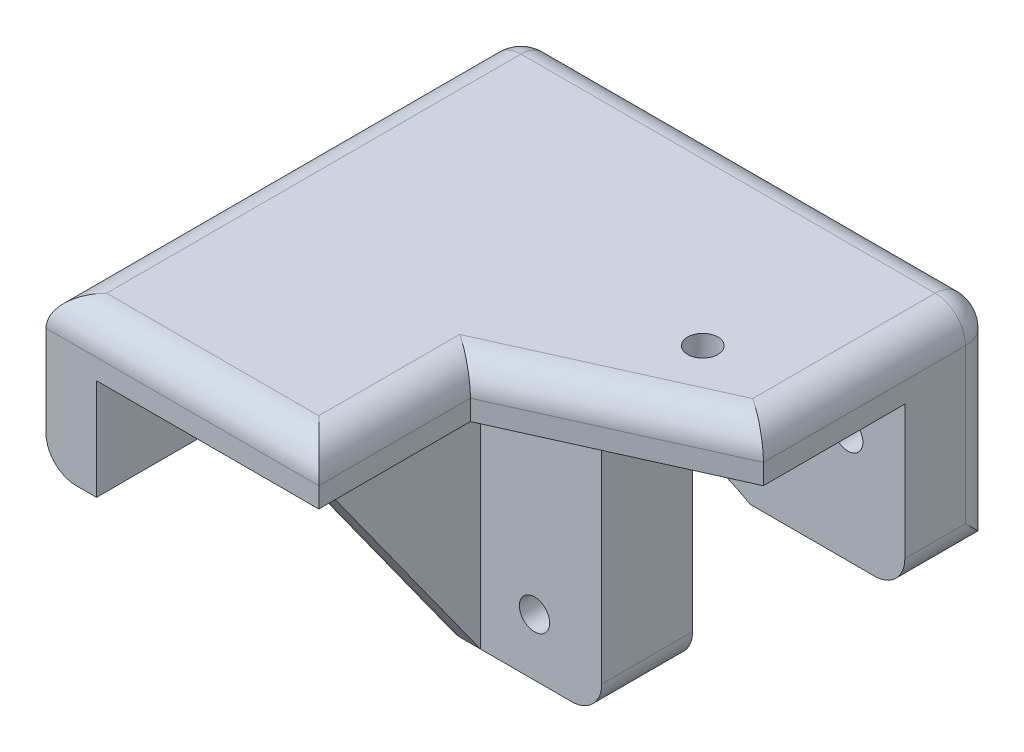
ISO-10303-21;
HEADER;
FILE_DESCRIPTION(('STEP AP214'),'2;1');
FILE_NAME('part.step','',(''),(''),'','','');
FILE_SCHEMA(('AUTOMOTIVE_DESIGN { 1 0 10303 214 1 1 1 1 }'));
ENDSEC;
DATA;
#1=APPLICATION_CONTEXT('core data for automotive mechanical design processes');
#2=APPLICATION_PROTOCOL_DEFINITION('international standard','automotive_design',2000,#1);
#3=PRODUCT_CONTEXT('',#1,'mechanical');
#4=PRODUCT('Part','Part','',(#3));
#5=PRODUCT_RELATED_PRODUCT_CATEGORY('part','',(#4));
#6=PRODUCT_DEFINITION_FORMATION('','',#4);
#7=PRODUCT_DEFINITION_CONTEXT('part definition',#1,'design');
#8=PRODUCT_DEFINITION('design','',#6,#7);
#9=PRODUCT_DEFINITION_SHAPE('','',#8);
#10=(LENGTH_UNIT() NAMED_UNIT(*) SI_UNIT(.MILLI.,.METRE.));
#11=(NAMED_UNIT(*) PLANE_ANGLE_UNIT() SI_UNIT($,.RADIAN.));
#12=(NAMED_UNIT(*) SI_UNIT($,.STERADIAN.) SOLID_ANGLE_UNIT());
#13=UNCERTAINTY_MEASURE_WITH_UNIT(LENGTH_MEASURE(1.E-05),#10,'distance_accuracy_value','');
#14=(GEOMETRIC_REPRESENTATION_CONTEXT(3) GLOBAL_UNCERTAINTY_ASSIGNED_CONTEXT((#13)) GLOBAL_UNIT_ASSIGNED_CONTEXT((#10,
#11,#12)) REPRESENTATION_CONTEXT('',''));
#15=CARTESIAN_POINT('',(0.,0.,0.));
#16=DIRECTION('',(0.,0.,1.));
#17=DIRECTION('',(1.,0.,0.));
#18=AXIS2_PLACEMENT_3D('',#15,#16,#17);
#19=CARTESIAN_POINT('',(37.,52.,19.));
#20=DIRECTION('',(0.,-1.,0.));
#21=DIRECTION('',(0.,0.,-1.));
#22=AXIS2_PLACEMENT_3D('',#19,#20,#21);
#23=CYLINDRICAL_SURFACE('',#22,1.5);
#24=CARTESIAN_POINT('',(37.,47.,19.));
#25=DIRECTION('',(0.,-1.,0.));
#26=DIRECTION('',(0.,0.,-1.));
#27=AXIS2_PLACEMENT_3D('',#24,#25,#26);
#28=CIRCLE('',#27,1.5);
#29=CARTESIAN_POINT('',(37.,47.,17.5));
#30=VERTEX_POINT('',#29);
#31=EDGE_CURVE('E327',#30,#30,#28,.T.);
#32=ORIENTED_EDGE('',*,*,#31,.F.);
#33=EDGE_LOOP('',(#32));
#34=FACE_BOUND('',#33,.T.);
#35=CARTESIAN_POINT('',(37.,44.,19.));
#36=DIRECTION('',(0.,-1.,0.));
#37=DIRECTION('',(0.,0.,-1.));
#38=AXIS2_PLACEMENT_3D('',#35,#36,#37);
#39=CIRCLE('',#38,1.5);
#40=CARTESIAN_POINT('',(37.,44.,17.5));
#41=VERTEX_POINT('',#40);
#42=EDGE_CURVE('E37',#41,#41,#39,.F.);
#43=ORIENTED_EDGE('',*,*,#42,.F.);
#44=EDGE_LOOP('',(#43));
#45=FACE_BOUND('',#44,.T.);
#46=ADVANCED_FACE('F33',(#34,#45),#23,.F.);
#47=CARTESIAN_POINT('',(47.,47.,9.));
#48=DIRECTION('',(-1.,0.,0.));
#49=DIRECTION('',(0.,-1.,0.));
#50=AXIS2_PLACEMENT_3D('',#47,#48,#49);
#51=PLANE('',#50);
#52=DIRECTION('',(0.,1.,0.));
#53=VECTOR('',#52,1.);
#54=CARTESIAN_POINT('',(47.,47.,3.));
#55=LINE('',#54,#53);
#56=CARTESIAN_POINT('',(47.,28.75,3.));
#57=VERTEX_POINT('',#56);
#58=CARTESIAN_POINT('',(47.,44.,3.));
#59=VERTEX_POINT('',#58);
#60=EDGE_CURVE('E295',#57,#59,#55,.T.);
#61=ORIENTED_EDGE('',*,*,#60,.T.);
#62=DIRECTION('',(0.,0.,-1.));
#63=VECTOR('',#62,1.);
#64=CARTESIAN_POINT('',(47.,44.,9.));
#65=LINE('',#64,#63);
#66=CARTESIAN_POINT('',(47.,44.,23.));
#67=VERTEX_POINT('',#66);
#68=EDGE_CURVE('E196',#59,#67,#65,.F.);
#69=ORIENTED_EDGE('',*,*,#68,.T.);
#70=DIRECTION('',(0.,-1.,0.));
#71=VECTOR('',#70,1.);
#72=CARTESIAN_POINT('',(47.,52.,23.));
#73=LINE('',#72,#71);
#74=CARTESIAN_POINT('',(47.,42.,23.));
#75=VERTEX_POINT('',#74);
#76=EDGE_CURVE('E188',#67,#75,#73,.T.);
#77=ORIENTED_EDGE('',*,*,#76,.T.);
#78=DIRECTION('',(0.,0.,-1.));
#79=VECTOR('',#78,1.);
#80=CARTESIAN_POINT('',(47.,42.,47.));
#81=LINE('',#80,#79);
#82=CARTESIAN_POINT('',(47.,42.,9.));
#83=VERTEX_POINT('',#82);
#84=EDGE_CURVE('E193',#75,#83,#81,.T.);
#85=ORIENTED_EDGE('',*,*,#84,.T.);
#86=DIRECTION('',(0.,1.,0.));
#87=VECTOR('',#86,1.);
#88=CARTESIAN_POINT('',(47.,47.,9.));
#89=LINE('',#88,#87);
#90=CARTESIAN_POINT('',(47.,28.75,9.));
#91=VERTEX_POINT('',#90);
#92=EDGE_CURVE('E502',#91,#83,#89,.T.);
#93=ORIENTED_EDGE('',*,*,#92,.F.);
#94=DIRECTION('',(0.,0.,-1.));
#95=VECTOR('',#94,1.);
#96=CARTESIAN_POINT('',(47.,28.75,9.));
#97=LINE('',#96,#95);
#98=EDGE_CURVE('E293',#91,#57,#97,.T.);
#99=ORIENTED_EDGE('',*,*,#98,.T.);
#100=EDGE_LOOP('',(#61,#69,#77,#85,#93,#99));
#101=FACE_BOUND('',#100,.T.);
#102=ADVANCED_FACE('F190',(#101),#51,.F.);
#103=CARTESIAN_POINT('',(0.,47.,9.));
#104=DIRECTION('',(0.,-1.,0.));
#105=DIRECTION('',(0.,0.,-1.));
#106=AXIS2_PLACEMENT_3D('',#103,#104,#105);
#107=PLANE('',#106);
#108=ORIENTED_EDGE('',*,*,#31,.T.);
#109=EDGE_LOOP('',(#108));
#110=FACE_BOUND('',#109,.T.);
#111=DIRECTION('',(0.,0.,-1.));
#112=VECTOR('',#111,1.);
#113=CARTESIAN_POINT('',(3.,47.,9.));
#114=LINE('',#113,#112);
#115=CARTESIAN_POINT('',(3.,47.,3.));
#116=VERTEX_POINT('',#115);
#117=CARTESIAN_POINT('',(3.,47.,44.));
#118=VERTEX_POINT('',#117);
#119=EDGE_CURVE('E270',#116,#118,#114,.F.);
#120=ORIENTED_EDGE('',*,*,#119,.T.);
#121=DIRECTION('',(-1.,0.,0.));
#122=VECTOR('',#121,1.);
#123=CARTESIAN_POINT('',(0.,47.,44.));
#124=LINE('',#123,#122);
#125=CARTESIAN_POINT('',(24.,47.,44.));
#126=VERTEX_POINT('',#125);
#127=EDGE_CURVE('E272',#118,#126,#124,.F.);
#128=ORIENTED_EDGE('',*,*,#127,.T.);
#129=DIRECTION('',(0.,0.,1.));
#130=VECTOR('',#129,1.);
#131=CARTESIAN_POINT('',(24.,47.,32.));
#132=LINE('',#131,#130);
#133=CARTESIAN_POINT('',(24.,47.,30.0602431700808));
#134=VERTEX_POINT('',#133);
#135=EDGE_CURVE('E262',#126,#134,#132,.F.);
#136=ORIENTED_EDGE('',*,*,#135,.T.);
#137=DIRECTION('',(-0.911921505175106,0.,0.410364677328798));
#138=VECTOR('',#137,1.);
#139=CARTESIAN_POINT('',(45.7689059680136,47.,20.2642354844747));
#140=LINE('',#139,#138);
#141=CARTESIAN_POINT('',(44.,47.,21.0602431700808));
#142=VERTEX_POINT('',#141);
#143=EDGE_CURVE('E264',#134,#142,#140,.F.);
#144=ORIENTED_EDGE('',*,*,#143,.T.);
#145=DIRECTION('',(0.,0.,-1.));
#146=VECTOR('',#145,1.);
#147=CARTESIAN_POINT('',(44.,47.,9.));
#148=LINE('',#147,#146);
#149=CARTESIAN_POINT('',(44.,47.,3.));
#150=VERTEX_POINT('',#149);
#151=EDGE_CURVE('E266',#142,#150,#148,.T.);
#152=ORIENTED_EDGE('',*,*,#151,.T.);
#153=DIRECTION('',(-1.,0.,0.));
#154=VECTOR('',#153,1.);
#155=CARTESIAN_POINT('',(0.,47.,3.));
#156=LINE('',#155,#154);
#157=EDGE_CURVE('E268',#150,#116,#156,.T.);
#158=ORIENTED_EDGE('',*,*,#157,.T.);
#159=EDGE_LOOP('',(#120,#128,#136,#144,#152,#158));
#160=FACE_BOUND('',#159,.T.);
#161=ADVANCED_FACE('F558',(#110,#160),#107,.F.);
#162=CARTESIAN_POINT('',(0.,0.,47.));
#163=DIRECTION('',(0.,0.,-1.));
#164=DIRECTION('',(-1.,0.,0.));
#165=AXIS2_PLACEMENT_3D('',#162,#163,#164);
#166=PLANE('',#165);
#167=DIRECTION('',(0.,-1.,0.));
#168=VECTOR('',#167,1.);
#169=CARTESIAN_POINT('',(27.,52.,47.));
#170=LINE('',#169,#168);
#171=CARTESIAN_POINT('',(27.,44.,47.));
#172=VERTEX_POINT('',#171);
#173=CARTESIAN_POINT('',(27.,42.,47.));
#174=VERTEX_POINT('',#173);
#175=EDGE_CURVE('E199',#172,#174,#170,.T.);
#176=ORIENTED_EDGE('',*,*,#175,.F.);
#177=DIRECTION('',(-1.,0.,0.));
#178=VECTOR('',#177,1.);
#179=CARTESIAN_POINT('',(0.,44.,47.));
#180=LINE('',#179,#178);
#181=CARTESIAN_POINT('',(0.,44.,47.));
#182=VERTEX_POINT('',#181);
#183=EDGE_CURVE('E259',#172,#182,#180,.T.);
#184=ORIENTED_EDGE('',*,*,#183,.T.);
#185=DIRECTION('',(0.,-1.,0.));
#186=VECTOR('',#185,1.);
#187=CARTESIAN_POINT('',(0.,0.,47.));
#188=LINE('',#187,#186);
#189=CARTESIAN_POINT('',(0.,35.,47.));
#190=VERTEX_POINT('',#189);
#191=EDGE_CURVE('E231',#182,#190,#188,.T.);
#192=ORIENTED_EDGE('',*,*,#191,.T.);
#193=CARTESIAN_POINT('',(3.,35.,47.));
#194=DIRECTION('',(0.,0.,-1.));
#195=DIRECTION('',(-1.,0.,0.));
#196=AXIS2_PLACEMENT_3D('',#193,#194,#195);
#197=CIRCLE('',#196,3.);
#198=CARTESIAN_POINT('',(3.,32.,47.));
#199=VERTEX_POINT('',#198);
#200=EDGE_CURVE('E255',#190,#199,#197,.F.);
#201=ORIENTED_EDGE('',*,*,#200,.T.);
#202=DIRECTION('',(1.,0.,0.));
#203=VECTOR('',#202,1.);
#204=CARTESIAN_POINT('',(0.,32.,47.));
#205=LINE('',#204,#203);
#206=CARTESIAN_POINT('',(5.,32.,47.));
#207=VERTEX_POINT('',#206);
#208=EDGE_CURVE('E249',#199,#207,#205,.T.);
#209=ORIENTED_EDGE('',*,*,#208,.T.);
#210=DIRECTION('',(0.,1.,0.));
#211=VECTOR('',#210,1.);
#212=CARTESIAN_POINT('',(5.,0.,47.));
#213=LINE('',#212,#211);
#214=CARTESIAN_POINT('',(5.,42.,47.));
#215=VERTEX_POINT('',#214);
#216=EDGE_CURVE('E234',#207,#215,#213,.T.);
#217=ORIENTED_EDGE('',*,*,#216,.T.);
#218=DIRECTION('',(1.,0.,0.));
#219=VECTOR('',#218,1.);
#220=CARTESIAN_POINT('',(5.,42.,47.));
#221=LINE('',#220,#219);
#222=EDGE_CURVE('E215',#215,#174,#221,.T.);
#223=ORIENTED_EDGE('',*,*,#222,.T.);
#224=EDGE_LOOP('',(#176,#184,#192,#201,#209,#217,#223));
#225=FACE_BOUND('',#224,.T.);
#226=ADVANCED_FACE('F452',(#225),#166,.F.);
#227=CARTESIAN_POINT('',(5.,42.,47.));
#228=DIRECTION('',(0.,1.,0.));
#229=DIRECTION('',(0.,0.,1.));
#230=AXIS2_PLACEMENT_3D('',#227,#228,#229);
#231=PLANE('',#230);
#232=CARTESIAN_POINT('',(37.,42.,19.));
#233=DIRECTION('',(0.,-1.,0.));
#234=DIRECTION('',(0.,0.,-1.));
#235=AXIS2_PLACEMENT_3D('',#232,#233,#234);
#236=CIRCLE('',#235,3.);
#237=CARTESIAN_POINT('',(37.,42.,16.));
#238=VERTEX_POINT('',#237);
#239=EDGE_CURVE('E901',#238,#238,#236,.T.);
#240=ORIENTED_EDGE('',*,*,#239,.F.);
#241=EDGE_LOOP('',(#240));
#242=FACE_BOUND('',#241,.T.);
#243=DIRECTION('',(0.,0.,1.));
#244=VECTOR('',#243,1.);
#245=CARTESIAN_POINT('',(27.,42.,0.));
#246=LINE('',#245,#244);
#247=CARTESIAN_POINT('',(27.,42.,32.));
#248=VERTEX_POINT('',#247);
#249=EDGE_CURVE('E209',#248,#174,#246,.T.);
#250=ORIENTED_EDGE('',*,*,#249,.T.);
#251=ORIENTED_EDGE('',*,*,#222,.F.);
#252=DIRECTION('',(0.,0.,-1.));
#253=VECTOR('',#252,1.);
#254=CARTESIAN_POINT('',(5.,42.,47.));
#255=LINE('',#254,#253);
#256=CARTESIAN_POINT('',(5.,42.,9.));
#257=VERTEX_POINT('',#256);
#258=EDGE_CURVE('E214',#215,#257,#255,.T.);
#259=ORIENTED_EDGE('',*,*,#258,.T.);
#260=DIRECTION('',(1.,0.,0.));
#261=VECTOR('',#260,1.);
#262=CARTESIAN_POINT('',(5.,42.,9.));
#263=LINE('',#262,#261);
#264=EDGE_CURVE('E213',#257,#83,#263,.T.);
#265=ORIENTED_EDGE('',*,*,#264,.T.);
#266=ORIENTED_EDGE('',*,*,#84,.F.);
#267=DIRECTION('',(-0.911921505175106,0.,0.410364677328798));
#268=VECTOR('',#267,1.);
#269=CARTESIAN_POINT('',(16.5218295218295,42.,36.7151767151767));
#270=LINE('',#269,#268);
#271=EDGE_CURVE('E203',#75,#248,#270,.T.);
#272=ORIENTED_EDGE('',*,*,#271,.T.);
#273=EDGE_LOOP('',(#250,#251,#259,#265,#266,#272));
#274=FACE_BOUND('',#273,.T.);
#275=ADVANCED_FACE('F211',(#242,#274),#231,.F.);
#276=CARTESIAN_POINT('',(22.211073436395,9.58705357720176,9.));
#277=DIRECTION('',(0.,0.,-1.));
#278=DIRECTION('',(-1.,0.,0.));
#279=AXIS2_PLACEMENT_3D('',#276,#277,#278);
#280=PLANE('',#279);
#281=CARTESIAN_POINT('',(41.35,36.65,9.));
#282=DIRECTION('',(0.,0.,1.));
#283=DIRECTION('',(1.,0.,0.));
#284=AXIS2_PLACEMENT_3D('',#281,#282,#283);
#285=CIRCLE('',#284,1.5);
#286=CARTESIAN_POINT('',(42.85,36.65,9.));
#287=VERTEX_POINT('',#286);
#288=EDGE_CURVE('E238',#287,#287,#285,.T.);
#289=ORIENTED_EDGE('',*,*,#288,.F.);
#290=EDGE_LOOP('',(#289));
#291=FACE_BOUND('',#290,.T.);
#292=CARTESIAN_POINT('',(10.35,36.65,9.));
#293=DIRECTION('',(0.,0.,1.));
#294=DIRECTION('',(1.,0.,0.));
#295=AXIS2_PLACEMENT_3D('',#292,#293,#294);
#296=CIRCLE('',#295,1.5);
#297=CARTESIAN_POINT('',(11.85,36.65,9.));
#298=VERTEX_POINT('',#297);
#299=EDGE_CURVE('E505',#298,#298,#296,.T.);
#300=ORIENTED_EDGE('',*,*,#299,.F.);
#301=EDGE_LOOP('',(#300));
#302=FACE_BOUND('',#301,.T.);
#303=CARTESIAN_POINT('',(10.35,5.65,9.));
#304=DIRECTION('',(0.,0.,1.));
#305=DIRECTION('',(1.,0.,0.));
#306=AXIS2_PLACEMENT_3D('',#303,#304,#305);
#307=CIRCLE('',#306,1.5);
#308=CARTESIAN_POINT('',(11.85,5.65,9.));
#309=VERTEX_POINT('',#308);
#310=EDGE_CURVE('E504',#309,#309,#307,.T.);
#311=ORIENTED_EDGE('',*,*,#310,.F.);
#312=EDGE_LOOP('',(#311));
#313=FACE_BOUND('',#312,.T.);
#314=DIRECTION('',(1.,0.,0.));
#315=VECTOR('',#314,1.);
#316=CARTESIAN_POINT('',(17.,0.,9.));
#317=LINE('',#316,#315);
#318=CARTESIAN_POINT('',(5.,0.,9.));
#319=VERTEX_POINT('',#318);
#320=CARTESIAN_POINT('',(14.,0.,9.));
#321=VERTEX_POINT('',#320);
#322=EDGE_CURVE('E246',#319,#321,#317,.T.);
#323=ORIENTED_EDGE('',*,*,#322,.T.);
#324=CARTESIAN_POINT('',(14.,3.,9.));
#325=DIRECTION('',(0.,0.,-1.));
#326=DIRECTION('',(-1.,0.,0.));
#327=AXIS2_PLACEMENT_3D('',#324,#325,#326);
#328=CIRCLE('',#327,3.);
#329=CARTESIAN_POINT('',(17.,3.,9.));
#330=VERTEX_POINT('',#329);
#331=EDGE_CURVE('E317',#321,#330,#328,.F.);
#332=ORIENTED_EDGE('',*,*,#331,.T.);
#333=DIRECTION('',(0.,1.,0.));
#334=VECTOR('',#333,1.);
#335=CARTESIAN_POINT('',(17.,0.,9.));
#336=LINE('',#335,#334);
#337=CARTESIAN_POINT('',(17.,25.1632657673138,9.));
#338=VERTEX_POINT('',#337);
#339=EDGE_CURVE('E491',#330,#338,#336,.T.);
#340=ORIENTED_EDGE('',*,*,#339,.T.);
#341=CARTESIAN_POINT('',(20.,25.1632657673138,9.));
#342=DIRECTION('',(0.,0.,-1.));
#343=DIRECTION('',(-1.,0.,0.));
#344=AXIS2_PLACEMENT_3D('',#341,#342,#343);
#345=CIRCLE('',#344,3.);
#346=CARTESIAN_POINT('',(19.5783709992043,28.1334894938516,9.));
#347=VERTEX_POINT('',#346);
#348=EDGE_CURVE('E11',#338,#347,#345,.T.);
#349=ORIENTED_EDGE('',*,*,#348,.T.);
#350=CARTESIAN_POINT('',(22.211073436395,9.58705357720176,9.));
#351=DIRECTION('',(0.,0.,-1.));
#352=DIRECTION('',(-1.,0.,0.));
#353=AXIS2_PLACEMENT_3D('',#350,#351,#352);
#354=CIRCLE('',#353,18.732362566777);
#355=CARTESIAN_POINT('',(31.68,25.75,9.));
#356=VERTEX_POINT('',#355);
#357=EDGE_CURVE('E493',#347,#356,#354,.T.);
#358=ORIENTED_EDGE('',*,*,#357,.T.);
#359=DIRECTION('',(1.,0.,0.));
#360=VECTOR('',#359,1.);
#361=CARTESIAN_POINT('',(47.,25.75,9.));
#362=LINE('',#361,#360);
#363=CARTESIAN_POINT('',(44.,25.75,9.));
#364=VERTEX_POINT('',#363);
#365=EDGE_CURVE('E525',#356,#364,#362,.T.);
#366=ORIENTED_EDGE('',*,*,#365,.T.);
#367=CARTESIAN_POINT('',(44.,28.75,9.));
#368=DIRECTION('',(0.,0.,-1.));
#369=DIRECTION('',(-1.,0.,0.));
#370=AXIS2_PLACEMENT_3D('',#367,#368,#369);
#371=CIRCLE('',#370,3.);
#372=EDGE_CURVE('E315',#364,#91,#371,.F.);
#373=ORIENTED_EDGE('',*,*,#372,.T.);
#374=ORIENTED_EDGE('',*,*,#92,.T.);
#375=ORIENTED_EDGE('',*,*,#264,.F.);
#376=DIRECTION('',(0.,1.,0.));
#377=VECTOR('',#376,1.);
#378=CARTESIAN_POINT('',(5.,0.,9.));
#379=LINE('',#378,#377);
#380=EDGE_CURVE('E235',#319,#257,#379,.T.);
#381=ORIENTED_EDGE('',*,*,#380,.F.);
#382=EDGE_LOOP('',(#323,#332,#340,#349,#358,#366,#373,#374,#375,#381));
#383=FACE_BOUND('',#382,.T.);
#384=ADVANCED_FACE('F487',(#291,#302,#313,#383),#280,.F.);
#385=CARTESIAN_POINT('',(5.,0.,47.));
#386=DIRECTION('',(-1.,0.,0.));
#387=DIRECTION('',(0.,0.,1.));
#388=AXIS2_PLACEMENT_3D('',#385,#386,#387);
#389=PLANE('',#388);
#390=ORIENTED_EDGE('',*,*,#258,.F.);
#391=ORIENTED_EDGE('',*,*,#216,.F.);
#392=DIRECTION('',(0.,0.,-1.));
#393=VECTOR('',#392,1.);
#394=CARTESIAN_POINT('',(5.,32.,47.));
#395=LINE('',#394,#393);
#396=CARTESIAN_POINT('',(5.,32.,32.));
#397=VERTEX_POINT('',#396);
#398=EDGE_CURVE('E230',#207,#397,#395,.T.);
#399=ORIENTED_EDGE('',*,*,#398,.T.);
#400=DIRECTION('',(0.,-0.812015371342713,-0.583636048152576));
#401=VECTOR('',#400,1.);
#402=CARTESIAN_POINT('',(5.,18.0090148100451,21.9439793947199));
#403=LINE('',#402,#401);
#404=EDGE_CURVE('E251',#397,#319,#403,.T.);
#405=ORIENTED_EDGE('',*,*,#404,.T.);
#406=ORIENTED_EDGE('',*,*,#380,.T.);
#407=EDGE_LOOP('',(#390,#391,#399,#405,#406));
#408=FACE_BOUND('',#407,.T.);
#409=ADVANCED_FACE('F483',(#408),#389,.F.);
#410=CARTESIAN_POINT('',(17.,0.,9.));
#411=DIRECTION('',(0.,1.,0.));
#412=DIRECTION('',(-1.,0.,0.));
#413=AXIS2_PLACEMENT_3D('',#410,#411,#412);
#414=PLANE('',#413);
#415=DIRECTION('',(-1.,0.,0.));
#416=VECTOR('',#415,1.);
#417=CARTESIAN_POINT('',(38.,0.,9.));
#418=LINE('',#417,#416);
#419=CARTESIAN_POINT('',(3.,0.,9.));
#420=VERTEX_POINT('',#419);
#421=EDGE_CURVE('E227',#319,#420,#418,.T.);
#422=ORIENTED_EDGE('',*,*,#421,.T.);
#423=DIRECTION('',(0.,0.,-1.));
#424=VECTOR('',#423,1.);
#425=CARTESIAN_POINT('',(3.,0.,9.));
#426=LINE('',#425,#424);
#427=CARTESIAN_POINT('',(3.,0.,0.));
#428=VERTEX_POINT('',#427);
#429=EDGE_CURVE('E308',#420,#428,#426,.T.);
#430=ORIENTED_EDGE('',*,*,#429,.T.);
#431=DIRECTION('',(1.,0.,0.));
#432=VECTOR('',#431,1.);
#433=CARTESIAN_POINT('',(17.,0.,0.));
#434=LINE('',#433,#432);
#435=CARTESIAN_POINT('',(14.,0.,0.));
#436=VERTEX_POINT('',#435);
#437=EDGE_CURVE('E402',#428,#436,#434,.T.);
#438=ORIENTED_EDGE('',*,*,#437,.T.);
#439=DIRECTION('',(0.,0.,-1.));
#440=VECTOR('',#439,1.);
#441=CARTESIAN_POINT('',(14.,0.,9.));
#442=LINE('',#441,#440);
#443=EDGE_CURVE('E306',#436,#321,#442,.F.);
#444=ORIENTED_EDGE('',*,*,#443,.T.);
#445=ORIENTED_EDGE('',*,*,#322,.F.);
#446=EDGE_LOOP('',(#422,#430,#438,#444,#445));
#447=FACE_BOUND('',#446,.T.);
#448=ADVANCED_FACE('F489',(#447),#414,.F.);
#449=CARTESIAN_POINT('',(17.,0.,9.));
#450=DIRECTION('',(-1.,0.,0.));
#451=DIRECTION('',(0.,0.,1.));
#452=AXIS2_PLACEMENT_3D('',#449,#450,#451);
#453=PLANE('',#452);
#454=ORIENTED_EDGE('',*,*,#339,.F.);
#455=DIRECTION('',(0.,0.,-1.));
#456=VECTOR('',#455,1.);
#457=CARTESIAN_POINT('',(17.,3.,9.));
#458=LINE('',#457,#456);
#459=CARTESIAN_POINT('',(17.,3.,0.));
#460=VERTEX_POINT('',#459);
#461=EDGE_CURVE('E312',#330,#460,#458,.T.);
#462=ORIENTED_EDGE('',*,*,#461,.T.);
#463=DIRECTION('',(0.,1.,0.));
#464=VECTOR('',#463,1.);
#465=CARTESIAN_POINT('',(17.,0.,0.));
#466=LINE('',#465,#464);
#467=CARTESIAN_POINT('',(17.,25.1632657673138,0.));
#468=VERTEX_POINT('',#467);
#469=EDGE_CURVE('E409',#460,#468,#466,.T.);
#470=ORIENTED_EDGE('',*,*,#469,.T.);
#471=DIRECTION('',(0.,0.,1.));
#472=VECTOR('',#471,1.);
#473=CARTESIAN_POINT('',(17.,25.1632657673138,9.));
#474=LINE('',#473,#472);
#475=EDGE_CURVE('E310',#468,#338,#474,.T.);
#476=ORIENTED_EDGE('',*,*,#475,.T.);
#477=EDGE_LOOP('',(#454,#462,#470,#476));
#478=FACE_BOUND('',#477,.T.);
#479=ADVANCED_FACE('F531',(#478),#453,.F.);
#480=CARTESIAN_POINT('',(22.211073436395,9.58705357720176,9.));
#481=DIRECTION('',(0.,0.,-1.));
#482=DIRECTION('',(-1.,0.,0.));
#483=AXIS2_PLACEMENT_3D('',#480,#481,#482);
#484=CYLINDRICAL_SURFACE('',#483,18.732362566777);
#485=ORIENTED_EDGE('',*,*,#357,.F.);
#486=DIRECTION('',(0.,0.,-1.));
#487=VECTOR('',#486,1.);
#488=CARTESIAN_POINT('',(19.5783709992043,28.1334894938516,9.));
#489=LINE('',#488,#487);
#490=CARTESIAN_POINT('',(19.5783709992043,28.1334894938516,0.));
#491=VERTEX_POINT('',#490);
#492=EDGE_CURVE('E319',#347,#491,#489,.T.);
#493=ORIENTED_EDGE('',*,*,#492,.T.);
#494=CARTESIAN_POINT('',(22.211073436395,9.58705357720176,0.));
#495=DIRECTION('',(0.,0.,-1.));
#496=DIRECTION('',(-1.,0.,0.));
#497=AXIS2_PLACEMENT_3D('',#494,#495,#496);
#498=CIRCLE('',#497,18.732362566777);
#499=CARTESIAN_POINT('',(31.68,25.75,0.));
#500=VERTEX_POINT('',#499);
#501=EDGE_CURVE('E495',#491,#500,#498,.T.);
#502=ORIENTED_EDGE('',*,*,#501,.T.);
#503=DIRECTION('',(0.,0.,-1.));
#504=VECTOR('',#503,1.);
#505=CARTESIAN_POINT('',(31.68,25.75,9.));
#506=LINE('',#505,#504);
#507=EDGE_CURVE('E252',#356,#500,#506,.T.);
#508=ORIENTED_EDGE('',*,*,#507,.F.);
#509=EDGE_LOOP('',(#485,#493,#502,#508));
#510=FACE_BOUND('',#509,.T.);
#511=ADVANCED_FACE('F537',(#510),#484,.F.);
#512=CARTESIAN_POINT('',(47.,25.75,9.));
#513=DIRECTION('',(0.,1.,0.));
#514=DIRECTION('',(-1.,0.,0.));
#515=AXIS2_PLACEMENT_3D('',#512,#513,#514);
#516=PLANE('',#515);
#517=DIRECTION('',(1.,0.,0.));
#518=VECTOR('',#517,1.);
#519=CARTESIAN_POINT('',(47.,25.75,0.));
#520=LINE('',#519,#518);
#521=CARTESIAN_POINT('',(44.,25.75,0.));
#522=VERTEX_POINT('',#521);
#523=EDGE_CURVE('E492',#500,#522,#520,.T.);
#524=ORIENTED_EDGE('',*,*,#523,.T.);
#525=DIRECTION('',(0.,0.,-1.));
#526=VECTOR('',#525,1.);
#527=CARTESIAN_POINT('',(44.,25.75,9.));
#528=LINE('',#527,#526);
#529=EDGE_CURVE('E50',#522,#364,#528,.F.);
#530=ORIENTED_EDGE('',*,*,#529,.T.);
#531=ORIENTED_EDGE('',*,*,#365,.F.);
#532=ORIENTED_EDGE('',*,*,#507,.T.);
#533=EDGE_LOOP('',(#524,#530,#531,#532));
#534=FACE_BOUND('',#533,.T.);
#535=ADVANCED_FACE('F599',(#534),#516,.F.);
#536=CARTESIAN_POINT('',(0.,0.,9.));
#537=DIRECTION('',(1.,0.,0.));
#538=DIRECTION('',(0.,0.,-1.));
#539=AXIS2_PLACEMENT_3D('',#536,#537,#538);
#540=PLANE('',#539);
#541=ORIENTED_EDGE('',*,*,#191,.F.);
#542=DIRECTION('',(0.,0.,-1.));
#543=VECTOR('',#542,1.);
#544=CARTESIAN_POINT('',(0.,44.,9.));
#545=LINE('',#544,#543);
#546=CARTESIAN_POINT('',(0.,44.,3.));
#547=VERTEX_POINT('',#546);
#548=EDGE_CURVE('E283',#182,#547,#545,.T.);
#549=ORIENTED_EDGE('',*,*,#548,.T.);
#550=DIRECTION('',(0.,-1.,0.));
#551=VECTOR('',#550,1.);
#552=CARTESIAN_POINT('',(0.,0.,3.));
#553=LINE('',#552,#551);
#554=CARTESIAN_POINT('',(0.,3.,3.));
#555=VERTEX_POINT('',#554);
#556=EDGE_CURVE('E277',#547,#555,#553,.T.);
#557=ORIENTED_EDGE('',*,*,#556,.T.);
#558=DIRECTION('',(0.,0.,-1.));
#559=VECTOR('',#558,1.);
#560=CARTESIAN_POINT('',(0.,3.,9.));
#561=LINE('',#560,#559);
#562=CARTESIAN_POINT('',(0.,3.,7.46173865714286));
#563=VERTEX_POINT('',#562);
#564=EDGE_CURVE('E275',#555,#563,#561,.F.);
#565=ORIENTED_EDGE('',*,*,#564,.T.);
#566=DIRECTION('',(0.,-0.812015371342713,-0.583636048152576));
#567=VECTOR('',#566,1.);
#568=CARTESIAN_POINT('',(0.,1.75090814445773,6.56395388597186));
#569=LINE('',#568,#567);
#570=CARTESIAN_POINT('',(0.,35.,30.4617386571429));
#571=VERTEX_POINT('',#570);
#572=EDGE_CURVE('E279',#563,#571,#569,.F.);
#573=ORIENTED_EDGE('',*,*,#572,.T.);
#574=DIRECTION('',(0.,0.,-1.));
#575=VECTOR('',#574,1.);
#576=CARTESIAN_POINT('',(0.,35.,9.));
#577=LINE('',#576,#575);
#578=EDGE_CURVE('E281',#571,#190,#577,.F.);
#579=ORIENTED_EDGE('',*,*,#578,.T.);
#580=EDGE_LOOP('',(#541,#549,#557,#565,#573,#579));
#581=FACE_BOUND('',#580,.T.);
#582=ADVANCED_FACE('F386',(#581),#540,.F.);
#583=CARTESIAN_POINT('',(22.211073436395,9.58705357720176,0.));
#584=DIRECTION('',(0.,0.,-1.));
#585=DIRECTION('',(-1.,0.,0.));
#586=AXIS2_PLACEMENT_3D('',#583,#584,#585);
#587=PLANE('',#586);
#588=CARTESIAN_POINT('',(10.,20.85,0.));
#589=DIRECTION('',(0.,0.,-1.));
#590=DIRECTION('',(-1.,0.,0.));
#591=AXIS2_PLACEMENT_3D('',#588,#589,#590);
#592=CIRCLE('',#591,4.);
#593=CARTESIAN_POINT('',(6.,20.85,0.));
#594=VERTEX_POINT('',#593);
#595=EDGE_CURVE('E371',#594,#594,#592,.T.);
#596=ORIENTED_EDGE('',*,*,#595,.F.);
#597=EDGE_LOOP('',(#596));
#598=FACE_BOUND('',#597,.T.);
#599=CARTESIAN_POINT('',(41.35,36.65,0.));
#600=DIRECTION('',(0.,0.,-1.));
#601=DIRECTION('',(-1.,0.,0.));
#602=AXIS2_PLACEMENT_3D('',#599,#600,#601);
#603=CIRCLE('',#602,1.5);
#604=CARTESIAN_POINT('',(39.85,36.65,0.));
#605=VERTEX_POINT('',#604);
#606=EDGE_CURVE('E391',#605,#605,#603,.T.);
#607=ORIENTED_EDGE('',*,*,#606,.F.);
#608=EDGE_LOOP('',(#607));
#609=FACE_BOUND('',#608,.T.);
#610=CARTESIAN_POINT('',(10.35,36.65,0.));
#611=DIRECTION('',(0.,0.,-1.));
#612=DIRECTION('',(-1.,0.,0.));
#613=AXIS2_PLACEMENT_3D('',#610,#611,#612);
#614=CIRCLE('',#613,1.5);
#615=CARTESIAN_POINT('',(8.85,36.65,0.));
#616=VERTEX_POINT('',#615);
#617=EDGE_CURVE('E395',#616,#616,#614,.T.);
#618=ORIENTED_EDGE('',*,*,#617,.F.);
#619=EDGE_LOOP('',(#618));
#620=FACE_BOUND('',#619,.T.);
#621=CARTESIAN_POINT('',(10.35,5.65,0.));
#622=DIRECTION('',(0.,0.,-1.));
#623=DIRECTION('',(-1.,0.,0.));
#624=AXIS2_PLACEMENT_3D('',#621,#622,#623);
#625=CIRCLE('',#624,1.5);
#626=CARTESIAN_POINT('',(8.85,5.65,0.));
#627=VERTEX_POINT('',#626);
#628=EDGE_CURVE('E399',#627,#627,#625,.T.);
#629=ORIENTED_EDGE('',*,*,#628,.F.);
#630=EDGE_LOOP('',(#629));
#631=FACE_BOUND('',#630,.T.);
#632=ORIENTED_EDGE('',*,*,#437,.F.);
#633=DIRECTION('',(0.,-1.,0.));
#634=VECTOR('',#633,1.);
#635=CARTESIAN_POINT('',(3.,47.,0.));
#636=LINE('',#635,#634);
#637=CARTESIAN_POINT('',(3.,44.,0.));
#638=VERTEX_POINT('',#637);
#639=EDGE_CURVE('E291',#428,#638,#636,.F.);
#640=ORIENTED_EDGE('',*,*,#639,.T.);
#641=DIRECTION('',(-1.,0.,0.));
#642=VECTOR('',#641,1.);
#643=CARTESIAN_POINT('',(47.,44.,0.));
#644=LINE('',#643,#642);
#645=CARTESIAN_POINT('',(44.,44.,0.));
#646=VERTEX_POINT('',#645);
#647=EDGE_CURVE('E289',#638,#646,#644,.F.);
#648=ORIENTED_EDGE('',*,*,#647,.T.);
#649=DIRECTION('',(0.,1.,0.));
#650=VECTOR('',#649,1.);
#651=CARTESIAN_POINT('',(44.,25.75,0.));
#652=LINE('',#651,#650);
#653=EDGE_CURVE('E287',#646,#522,#652,.F.);
#654=ORIENTED_EDGE('',*,*,#653,.T.);
#655=ORIENTED_EDGE('',*,*,#523,.F.);
#656=ORIENTED_EDGE('',*,*,#501,.F.);
#657=CARTESIAN_POINT('',(20.,25.1632657673138,0.));
#658=DIRECTION('',(0.,0.,-1.));
#659=DIRECTION('',(-1.,0.,0.));
#660=AXIS2_PLACEMENT_3D('',#657,#658,#659);
#661=CIRCLE('',#660,3.);
#662=EDGE_CURVE('E42',#491,#468,#661,.F.);
#663=ORIENTED_EDGE('',*,*,#662,.T.);
#664=ORIENTED_EDGE('',*,*,#469,.F.);
#665=CARTESIAN_POINT('',(14.,3.,0.));
#666=DIRECTION('',(0.,0.,-1.));
#667=DIRECTION('',(-1.,0.,0.));
#668=AXIS2_PLACEMENT_3D('',#665,#666,#667);
#669=CIRCLE('',#668,3.);
#670=EDGE_CURVE('E285',#460,#436,#669,.T.);
#671=ORIENTED_EDGE('',*,*,#670,.T.);
#672=EDGE_LOOP('',(#632,#640,#648,#654,#655,#656,#663,#664,#671));
#673=FACE_BOUND('',#672,.T.);
#674=ADVANCED_FACE('F382',(#598,#609,#620,#631,#673),#587,.T.);
#675=CARTESIAN_POINT('',(10.35,5.65,-1.));
#676=DIRECTION('',(0.,0.,1.));
#677=DIRECTION('',(1.,0.,0.));
#678=AXIS2_PLACEMENT_3D('',#675,#676,#677);
#679=CYLINDRICAL_SURFACE('',#678,1.5);
#680=ORIENTED_EDGE('',*,*,#628,.T.);
#681=EDGE_LOOP('',(#680));
#682=FACE_BOUND('',#681,.T.);
#683=ORIENTED_EDGE('',*,*,#310,.T.);
#684=EDGE_LOOP('',(#683));
#685=FACE_BOUND('',#684,.T.);
#686=ADVANCED_FACE('F385',(#682,#685),#679,.F.);
#687=CARTESIAN_POINT('',(10.35,36.65,-1.));
#688=DIRECTION('',(0.,0.,1.));
#689=DIRECTION('',(1.,0.,0.));
#690=AXIS2_PLACEMENT_3D('',#687,#688,#689);
#691=CYLINDRICAL_SURFACE('',#690,1.5);
#692=ORIENTED_EDGE('',*,*,#617,.T.);
#693=EDGE_LOOP('',(#692));
#694=FACE_BOUND('',#693,.T.);
#695=ORIENTED_EDGE('',*,*,#299,.T.);
#696=EDGE_LOOP('',(#695));
#697=FACE_BOUND('',#696,.T.);
#698=ADVANCED_FACE('F590',(#694,#697),#691,.F.);
#699=CARTESIAN_POINT('',(41.35,36.65,-1.));
#700=DIRECTION('',(0.,0.,1.));
#701=DIRECTION('',(1.,0.,0.));
#702=AXIS2_PLACEMENT_3D('',#699,#700,#701);
#703=CYLINDRICAL_SURFACE('',#702,1.5);
#704=ORIENTED_EDGE('',*,*,#606,.T.);
#705=EDGE_LOOP('',(#704));
#706=FACE_BOUND('',#705,.T.);
#707=ORIENTED_EDGE('',*,*,#288,.T.);
#708=EDGE_LOOP('',(#707));
#709=FACE_BOUND('',#708,.T.);
#710=ADVANCED_FACE('F511',(#706,#709),#703,.F.);
#711=CARTESIAN_POINT('',(38.,32.,32.));
#712=DIRECTION('',(0.,0.583636048152576,-0.812015371342713));
#713=DIRECTION('',(0.,0.812015371342713,0.583636048152576));
#714=AXIS2_PLACEMENT_3D('',#711,#712,#713);
#715=PLANE('',#714);
#716=DIRECTION('',(-1.,0.,0.));
#717=VECTOR('',#716,1.);
#718=CARTESIAN_POINT('',(38.,32.,32.));
#719=LINE('',#718,#717);
#720=CARTESIAN_POINT('',(3.,32.,32.));
#721=VERTEX_POINT('',#720);
#722=EDGE_CURVE('E217',#397,#721,#719,.T.);
#723=ORIENTED_EDGE('',*,*,#722,.T.);
#724=DIRECTION('',(0.,-0.812015371342713,-0.583636048152576));
#725=VECTOR('',#724,1.);
#726=CARTESIAN_POINT('',(3.,32.,32.));
#727=LINE('',#726,#725);
#728=EDGE_CURVE('E304',#721,#420,#727,.T.);
#729=ORIENTED_EDGE('',*,*,#728,.T.);
#730=ORIENTED_EDGE('',*,*,#421,.F.);
#731=ORIENTED_EDGE('',*,*,#404,.F.);
#732=EDGE_LOOP('',(#723,#729,#730,#731));
#733=FACE_BOUND('',#732,.T.);
#734=ADVANCED_FACE('F479',(#733),#715,.F.);
#735=CARTESIAN_POINT('',(38.,32.,47.));
#736=DIRECTION('',(0.,1.,0.));
#737=DIRECTION('',(0.,0.,1.));
#738=AXIS2_PLACEMENT_3D('',#735,#736,#737);
#739=PLANE('',#738);
#740=ORIENTED_EDGE('',*,*,#208,.F.);
#741=DIRECTION('',(0.,0.,-1.));
#742=VECTOR('',#741,1.);
#743=CARTESIAN_POINT('',(3.,32.,47.));
#744=LINE('',#743,#742);
#745=EDGE_CURVE('E302',#199,#721,#744,.T.);
#746=ORIENTED_EDGE('',*,*,#745,.T.);
#747=ORIENTED_EDGE('',*,*,#722,.F.);
#748=ORIENTED_EDGE('',*,*,#398,.F.);
#749=EDGE_LOOP('',(#740,#746,#747,#748));
#750=FACE_BOUND('',#749,.T.);
#751=ADVANCED_FACE('F475',(#750),#739,.F.);
#752=CARTESIAN_POINT('',(10.,20.85,5.));
#753=DIRECTION('',(0.,0.,-1.));
#754=DIRECTION('',(-1.,0.,0.));
#755=AXIS2_PLACEMENT_3D('',#752,#753,#754);
#756=CYLINDRICAL_SURFACE('',#755,4.);
#757=CARTESIAN_POINT('',(10.,20.85,5.));
#758=DIRECTION('',(0.,0.,-1.));
#759=DIRECTION('',(-1.,0.,0.));
#760=AXIS2_PLACEMENT_3D('',#757,#758,#759);
#761=CIRCLE('',#760,4.);
#762=CARTESIAN_POINT('',(6.,20.85,5.));
#763=VERTEX_POINT('',#762);
#764=EDGE_CURVE('E374',#763,#763,#761,.T.);
#765=ORIENTED_EDGE('',*,*,#764,.F.);
#766=EDGE_LOOP('',(#765));
#767=FACE_BOUND('',#766,.T.);
#768=ORIENTED_EDGE('',*,*,#595,.T.);
#769=EDGE_LOOP('',(#768));
#770=FACE_BOUND('',#769,.T.);
#771=ADVANCED_FACE('F380',(#767,#770),#756,.F.);
#772=CARTESIAN_POINT('',(10.,20.85,5.));
#773=DIRECTION('',(0.,0.,-1.));
#774=DIRECTION('',(-1.,0.,0.));
#775=AXIS2_PLACEMENT_3D('',#772,#773,#774);
#776=PLANE('',#775);
#777=ORIENTED_EDGE('',*,*,#764,.T.);
#778=EDGE_LOOP('',(#777));
#779=FACE_BOUND('',#778,.T.);
#780=ADVANCED_FACE('F570',(#779),#776,.T.);
#781=CARTESIAN_POINT('',(27.,52.,0.));
#782=DIRECTION('',(1.,0.,0.));
#783=DIRECTION('',(0.,0.,-1.));
#784=AXIS2_PLACEMENT_3D('',#781,#782,#783);
#785=PLANE('',#784);
#786=DIRECTION('',(0.,-1.,0.));
#787=VECTOR('',#786,1.);
#788=CARTESIAN_POINT('',(27.,52.,32.));
#789=LINE('',#788,#787);
#790=CARTESIAN_POINT('',(27.,44.,32.));
#791=VERTEX_POINT('',#790);
#792=EDGE_CURVE('E200',#791,#248,#789,.T.);
#793=ORIENTED_EDGE('',*,*,#792,.F.);
#794=DIRECTION('',(0.,0.,1.));
#795=VECTOR('',#794,1.);
#796=CARTESIAN_POINT('',(27.,44.,47.));
#797=LINE('',#796,#795);
#798=EDGE_CURVE('E300',#791,#172,#797,.T.);
#799=ORIENTED_EDGE('',*,*,#798,.T.);
#800=ORIENTED_EDGE('',*,*,#175,.T.);
#801=ORIENTED_EDGE('',*,*,#249,.F.);
#802=EDGE_LOOP('',(#793,#799,#800,#801));
#803=FACE_BOUND('',#802,.T.);
#804=ADVANCED_FACE('F448',(#803),#785,.T.);
#805=CARTESIAN_POINT('',(16.5218295218295,52.,36.7151767151767));
#806=DIRECTION('',(0.410364677328798,0.,0.911921505175106));
#807=DIRECTION('',(0.911921505175106,0.,-0.410364677328798));
#808=AXIS2_PLACEMENT_3D('',#805,#806,#807);
#809=PLANE('',#808);
#810=ORIENTED_EDGE('',*,*,#76,.F.);
#811=DIRECTION('',(-0.911921505175106,0.,0.410364677328798));
#812=VECTOR('',#811,1.);
#813=CARTESIAN_POINT('',(27.,44.,32.));
#814=LINE('',#813,#812);
#815=EDGE_CURVE('E298',#67,#791,#814,.T.);
#816=ORIENTED_EDGE('',*,*,#815,.T.);
#817=ORIENTED_EDGE('',*,*,#792,.T.);
#818=ORIENTED_EDGE('',*,*,#271,.F.);
#819=EDGE_LOOP('',(#810,#816,#817,#818));
#820=FACE_BOUND('',#819,.T.);
#821=ADVANCED_FACE('F204',(#820),#809,.T.);
#822=CARTESIAN_POINT('',(3.,35.,47.));
#823=DIRECTION('',(0.,0.,-1.));
#824=DIRECTION('',(-1.,0.,0.));
#825=AXIS2_PLACEMENT_3D('',#822,#823,#824);
#826=CYLINDRICAL_SURFACE('',#825,3.);
#827=ORIENTED_EDGE('',*,*,#200,.F.);
#828=ORIENTED_EDGE('',*,*,#578,.F.);
#829=CARTESIAN_POINT('',(3.,35.,30.4617386571429));
#830=DIRECTION('',(0.,-0.456269630726955,-0.88984157245899));
#831=DIRECTION('',(0.,0.88984157245899,-0.456269630726955));
#832=AXIS2_PLACEMENT_3D('',#829,#830,#831);
#833=ELLIPSE('',#832,3.37138665224394,3.);
#834=EDGE_CURVE('E361',#721,#571,#833,.T.);
#835=ORIENTED_EDGE('',*,*,#834,.F.);
#836=ORIENTED_EDGE('',*,*,#745,.F.);
#837=EDGE_LOOP('',(#827,#828,#835,#836));
#838=FACE_BOUND('',#837,.T.);
#839=ADVANCED_FACE('F471',(#838),#826,.T.);
#840=CARTESIAN_POINT('',(44.,28.75,9.));
#841=DIRECTION('',(0.,0.,-1.));
#842=DIRECTION('',(-1.,0.,0.));
#843=AXIS2_PLACEMENT_3D('',#840,#841,#842);
#844=CYLINDRICAL_SURFACE('',#843,3.);
#845=ORIENTED_EDGE('',*,*,#372,.F.);
#846=ORIENTED_EDGE('',*,*,#529,.F.);
#847=CARTESIAN_POINT('',(44.,28.75,3.));
#848=DIRECTION('',(0.,0.707106781186547,-0.707106781186547));
#849=DIRECTION('',(0.,-0.707106781186547,-0.707106781186547));
#850=AXIS2_PLACEMENT_3D('',#847,#848,#849);
#851=ELLIPSE('',#850,4.24264068711928,3.);
#852=EDGE_CURVE('E359',#57,#522,#851,.T.);
#853=ORIENTED_EDGE('',*,*,#852,.F.);
#854=ORIENTED_EDGE('',*,*,#98,.F.);
#855=EDGE_LOOP('',(#845,#846,#853,#854));
#856=FACE_BOUND('',#855,.T.);
#857=ADVANCED_FACE('F542',(#856),#844,.T.);
#858=CARTESIAN_POINT('',(3.,33.7509081444577,29.5639538859719));
#859=DIRECTION('',(0.,-0.812015371342713,-0.583636048152576));
#860=DIRECTION('',(0.,0.583636048152576,-0.812015371342713));
#861=AXIS2_PLACEMENT_3D('',#858,#859,#860);
#862=CYLINDRICAL_SURFACE('',#861,3.);
#863=ORIENTED_EDGE('',*,*,#834,.T.);
#864=ORIENTED_EDGE('',*,*,#572,.F.);
#865=CARTESIAN_POINT('',(3.,3.,7.46173865714286));
#866=DIRECTION('',(0.,-0.456269630726955,-0.88984157245899));
#867=DIRECTION('',(0.,0.88984157245899,-0.456269630726955));
#868=AXIS2_PLACEMENT_3D('',#865,#866,#867);
#869=ELLIPSE('',#868,3.37138665224394,3.);
#870=EDGE_CURVE('E356',#420,#563,#869,.T.);
#871=ORIENTED_EDGE('',*,*,#870,.F.);
#872=ORIENTED_EDGE('',*,*,#728,.F.);
#873=EDGE_LOOP('',(#863,#864,#871,#872));
#874=FACE_BOUND('',#873,.T.);
#875=ADVANCED_FACE('F544',(#874),#862,.T.);
#876=CARTESIAN_POINT('',(44.,47.,3.));
#877=DIRECTION('',(0.,-1.,0.));
#878=DIRECTION('',(1.,0.,0.));
#879=AXIS2_PLACEMENT_3D('',#876,#877,#878);
#880=CYLINDRICAL_SURFACE('',#879,3.);
#881=ORIENTED_EDGE('',*,*,#852,.T.);
#882=ORIENTED_EDGE('',*,*,#653,.F.);
#883=CARTESIAN_POINT('',(44.,44.,3.));
#884=DIRECTION('',(0.,1.,0.));
#885=DIRECTION('',(0.,0.,1.));
#886=AXIS2_PLACEMENT_3D('',#883,#884,#885);
#887=CIRCLE('',#886,3.);
#888=EDGE_CURVE('E353',#59,#646,#887,.T.);
#889=ORIENTED_EDGE('',*,*,#888,.F.);
#890=ORIENTED_EDGE('',*,*,#60,.F.);
#891=EDGE_LOOP('',(#881,#882,#889,#890));
#892=FACE_BOUND('',#891,.T.);
#893=ADVANCED_FACE('F432',(#892),#880,.T.);
#894=CARTESIAN_POINT('',(3.,3.,9.));
#895=DIRECTION('',(0.,0.,-1.));
#896=DIRECTION('',(-1.,0.,0.));
#897=AXIS2_PLACEMENT_3D('',#894,#895,#896);
#898=CYLINDRICAL_SURFACE('',#897,3.);
#899=ORIENTED_EDGE('',*,*,#870,.T.);
#900=ORIENTED_EDGE('',*,*,#564,.F.);
#901=CARTESIAN_POINT('',(3.,3.,3.));
#902=DIRECTION('',(0.,0.707106781186547,-0.707106781186547));
#903=DIRECTION('',(0.,-0.707106781186547,-0.707106781186547));
#904=AXIS2_PLACEMENT_3D('',#901,#902,#903);
#905=ELLIPSE('',#904,4.24264068711928,3.);
#906=EDGE_CURVE('E347',#428,#555,#905,.T.);
#907=ORIENTED_EDGE('',*,*,#906,.F.);
#908=ORIENTED_EDGE('',*,*,#429,.F.);
#909=EDGE_LOOP('',(#899,#900,#907,#908));
#910=FACE_BOUND('',#909,.T.);
#911=ADVANCED_FACE('F414',(#910),#898,.T.);
#912=CARTESIAN_POINT('',(44.,44.,3.));
#913=DIRECTION('',(0.,0.,1.));
#914=DIRECTION('',(1.,0.,0.));
#915=AXIS2_PLACEMENT_3D('',#912,#913,#914);
#916=SPHERICAL_SURFACE('',#915,3.);
#917=CARTESIAN_POINT('',(44.,44.,3.));
#918=DIRECTION('',(1.,0.,0.));
#919=DIRECTION('',(0.,0.,-1.));
#920=AXIS2_PLACEMENT_3D('',#917,#918,#919);
#921=CIRCLE('',#920,3.);
#922=EDGE_CURVE('E344',#150,#646,#921,.F.);
#923=ORIENTED_EDGE('',*,*,#922,.F.);
#924=CARTESIAN_POINT('',(44.,44.,3.));
#925=DIRECTION('',(0.,0.,-1.));
#926=DIRECTION('',(-1.,0.,0.));
#927=AXIS2_PLACEMENT_3D('',#924,#925,#926);
#928=CIRCLE('',#927,3.);
#929=EDGE_CURVE('E350',#59,#150,#928,.F.);
#930=ORIENTED_EDGE('',*,*,#929,.F.);
#931=ORIENTED_EDGE('',*,*,#888,.T.);
#932=EDGE_LOOP('',(#923,#930,#931));
#933=FACE_BOUND('',#932,.T.);
#934=ADVANCED_FACE('F437',(#933),#916,.T.);
#935=CARTESIAN_POINT('',(44.,44.,9.));
#936=DIRECTION('',(0.,0.,-1.));
#937=DIRECTION('',(-1.,0.,0.));
#938=AXIS2_PLACEMENT_3D('',#935,#936,#937);
#939=CYLINDRICAL_SURFACE('',#938,3.);
#940=ORIENTED_EDGE('',*,*,#929,.T.);
#941=ORIENTED_EDGE('',*,*,#151,.F.);
#942=CARTESIAN_POINT('',(44.,44.,21.0602431700808));
#943=DIRECTION('',(0.542971142267801,0.,-0.83975135526202));
#944=DIRECTION('',(0.83975135526202,0.,0.542971142267801));
#945=AXIS2_PLACEMENT_3D('',#942,#943,#944);
#946=ELLIPSE('',#945,3.57248604744905,3.);
#947=EDGE_CURVE('E341',#67,#142,#946,.F.);
#948=ORIENTED_EDGE('',*,*,#947,.F.);
#949=ORIENTED_EDGE('',*,*,#68,.F.);
#950=EDGE_LOOP('',(#940,#941,#948,#949));
#951=FACE_BOUND('',#950,.T.);
#952=ADVANCED_FACE('F440',(#951),#939,.T.);
#953=CARTESIAN_POINT('',(3.,0.,3.));
#954=DIRECTION('',(0.,1.,0.));
#955=DIRECTION('',(0.,0.,1.));
#956=AXIS2_PLACEMENT_3D('',#953,#954,#955);
#957=CYLINDRICAL_SURFACE('',#956,3.);
#958=ORIENTED_EDGE('',*,*,#906,.T.);
#959=ORIENTED_EDGE('',*,*,#556,.F.);
#960=CARTESIAN_POINT('',(3.,44.,3.));
#961=DIRECTION('',(0.,1.,0.));
#962=DIRECTION('',(0.,0.,1.));
#963=AXIS2_PLACEMENT_3D('',#960,#961,#962);
#964=CIRCLE('',#963,3.);
#965=EDGE_CURVE('E338',#638,#547,#964,.T.);
#966=ORIENTED_EDGE('',*,*,#965,.F.);
#967=ORIENTED_EDGE('',*,*,#639,.F.);
#968=EDGE_LOOP('',(#958,#959,#966,#967));
#969=FACE_BOUND('',#968,.T.);
#970=ADVANCED_FACE('F418',(#969),#957,.T.);
#971=CARTESIAN_POINT('',(0.,44.,3.));
#972=DIRECTION('',(1.,0.,0.));
#973=DIRECTION('',(0.,0.,-1.));
#974=AXIS2_PLACEMENT_3D('',#971,#972,#973);
#975=CYLINDRICAL_SURFACE('',#974,3.);
#976=ORIENTED_EDGE('',*,*,#922,.T.);
#977=ORIENTED_EDGE('',*,*,#647,.F.);
#978=CARTESIAN_POINT('',(3.,44.,3.));
#979=DIRECTION('',(-1.,0.,0.));
#980=DIRECTION('',(0.,0.,1.));
#981=AXIS2_PLACEMENT_3D('',#978,#979,#980);
#982=CIRCLE('',#981,3.);
#983=EDGE_CURVE('E335',#116,#638,#982,.T.);
#984=ORIENTED_EDGE('',*,*,#983,.F.);
#985=ORIENTED_EDGE('',*,*,#157,.F.);
#986=EDGE_LOOP('',(#976,#977,#984,#985));
#987=FACE_BOUND('',#986,.T.);
#988=ADVANCED_FACE('F426',(#987),#975,.T.);
#989=CARTESIAN_POINT('',(15.2907354898431,44.,33.9794121996514));
#990=DIRECTION('',(0.911921505175106,0.,-0.410364677328798));
#991=DIRECTION('',(-0.410364677328798,0.,-0.911921505175106));
#992=AXIS2_PLACEMENT_3D('',#989,#990,#991);
#993=CYLINDRICAL_SURFACE('',#992,3.);
#994=ORIENTED_EDGE('',*,*,#947,.T.);
#995=ORIENTED_EDGE('',*,*,#143,.F.);
#996=CARTESIAN_POINT('',(24.,44.,30.0602431700808));
#997=DIRECTION('',(0.542971142267802,0.,-0.83975135526202));
#998=DIRECTION('',(0.83975135526202,0.,0.542971142267801));
#999=AXIS2_PLACEMENT_3D('',#996,#997,#998);
#1000=ELLIPSE('',#999,3.57248604744905,3.);
#1001=EDGE_CURVE('E332',#791,#134,#1000,.F.);
#1002=ORIENTED_EDGE('',*,*,#1001,.F.);
#1003=ORIENTED_EDGE('',*,*,#815,.F.);
#1004=EDGE_LOOP('',(#994,#995,#1002,#1003));
#1005=FACE_BOUND('',#1004,.T.);
#1006=ADVANCED_FACE('F445',(#1005),#993,.T.);
#1007=CARTESIAN_POINT('',(3.,44.,3.));
#1008=DIRECTION('',(0.,0.,1.));
#1009=DIRECTION('',(1.,0.,0.));
#1010=AXIS2_PLACEMENT_3D('',#1007,#1008,#1009);
#1011=SPHERICAL_SURFACE('',#1010,3.);
#1012=ORIENTED_EDGE('',*,*,#983,.T.);
#1013=ORIENTED_EDGE('',*,*,#965,.T.);
#1014=CARTESIAN_POINT('',(3.,44.,3.));
#1015=DIRECTION('',(0.,0.,-1.));
#1016=DIRECTION('',(-1.,0.,0.));
#1017=AXIS2_PLACEMENT_3D('',#1014,#1015,#1016);
#1018=CIRCLE('',#1017,3.);
#1019=EDGE_CURVE('E329',#116,#547,#1018,.F.);
#1020=ORIENTED_EDGE('',*,*,#1019,.F.);
#1021=EDGE_LOOP('',(#1012,#1013,#1020));
#1022=FACE_BOUND('',#1021,.T.);
#1023=ADVANCED_FACE('F422',(#1022),#1011,.T.);
#1024=CARTESIAN_POINT('',(24.,44.,0.));
#1025=DIRECTION('',(0.,0.,-1.));
#1026=DIRECTION('',(-1.,0.,0.));
#1027=AXIS2_PLACEMENT_3D('',#1024,#1025,#1026);
#1028=CYLINDRICAL_SURFACE('',#1027,3.);
#1029=ORIENTED_EDGE('',*,*,#1001,.T.);
#1030=ORIENTED_EDGE('',*,*,#135,.F.);
#1031=CARTESIAN_POINT('',(24.,44.,44.));
#1032=DIRECTION('',(0.707106781186548,0.,-0.707106781186547));
#1033=DIRECTION('',(-0.707106781186547,0.,-0.707106781186548));
#1034=AXIS2_PLACEMENT_3D('',#1031,#1032,#1033);
#1035=ELLIPSE('',#1034,4.24264068711928,3.);
#1036=EDGE_CURVE('E326',#172,#126,#1035,.F.);
#1037=ORIENTED_EDGE('',*,*,#1036,.F.);
#1038=ORIENTED_EDGE('',*,*,#798,.F.);
#1039=EDGE_LOOP('',(#1029,#1030,#1037,#1038));
#1040=FACE_BOUND('',#1039,.T.);
#1041=ADVANCED_FACE('F457',(#1040),#1028,.T.);
#1042=CARTESIAN_POINT('',(3.,44.,9.));
#1043=DIRECTION('',(0.,0.,-1.));
#1044=DIRECTION('',(-1.,0.,0.));
#1045=AXIS2_PLACEMENT_3D('',#1042,#1043,#1044);
#1046=CYLINDRICAL_SURFACE('',#1045,3.);
#1047=ORIENTED_EDGE('',*,*,#1019,.T.);
#1048=ORIENTED_EDGE('',*,*,#548,.F.);
#1049=CARTESIAN_POINT('',(3.,44.,44.));
#1050=DIRECTION('',(-0.707106781186547,0.,-0.707106781186547));
#1051=DIRECTION('',(0.707106781186547,0.,-0.707106781186547));
#1052=AXIS2_PLACEMENT_3D('',#1049,#1050,#1051);
#1053=ELLIPSE('',#1052,4.24264068711928,3.);
#1054=EDGE_CURVE('E324',#118,#182,#1053,.F.);
#1055=ORIENTED_EDGE('',*,*,#1054,.F.);
#1056=ORIENTED_EDGE('',*,*,#119,.F.);
#1057=EDGE_LOOP('',(#1047,#1048,#1055,#1056));
#1058=FACE_BOUND('',#1057,.T.);
#1059=ADVANCED_FACE('F464',(#1058),#1046,.T.);
#1060=CARTESIAN_POINT('',(0.,44.,44.));
#1061=DIRECTION('',(-1.,0.,0.));
#1062=DIRECTION('',(0.,0.,1.));
#1063=AXIS2_PLACEMENT_3D('',#1060,#1061,#1062);
#1064=CYLINDRICAL_SURFACE('',#1063,3.);
#1065=ORIENTED_EDGE('',*,*,#1036,.T.);
#1066=ORIENTED_EDGE('',*,*,#127,.F.);
#1067=ORIENTED_EDGE('',*,*,#1054,.T.);
#1068=ORIENTED_EDGE('',*,*,#183,.F.);
#1069=EDGE_LOOP('',(#1065,#1066,#1067,#1068));
#1070=FACE_BOUND('',#1069,.T.);
#1071=ADVANCED_FACE('F460',(#1070),#1064,.T.);
#1072=CARTESIAN_POINT('',(14.,3.,9.));
#1073=DIRECTION('',(0.,0.,-1.));
#1074=DIRECTION('',(-1.,0.,0.));
#1075=AXIS2_PLACEMENT_3D('',#1072,#1073,#1074);
#1076=CYLINDRICAL_SURFACE('',#1075,3.);
#1077=ORIENTED_EDGE('',*,*,#331,.F.);
#1078=ORIENTED_EDGE('',*,*,#443,.F.);
#1079=ORIENTED_EDGE('',*,*,#670,.F.);
#1080=ORIENTED_EDGE('',*,*,#461,.F.);
#1081=EDGE_LOOP('',(#1077,#1078,#1079,#1080));
#1082=FACE_BOUND('',#1081,.T.);
#1083=ADVANCED_FACE('F613',(#1082),#1076,.T.);
#1084=CARTESIAN_POINT('',(20.,25.1632657673138,9.));
#1085=DIRECTION('',(0.,0.,-1.));
#1086=DIRECTION('',(-1.,0.,0.));
#1087=AXIS2_PLACEMENT_3D('',#1084,#1085,#1086);
#1088=CYLINDRICAL_SURFACE('',#1087,3.);
#1089=ORIENTED_EDGE('',*,*,#348,.F.);
#1090=ORIENTED_EDGE('',*,*,#475,.F.);
#1091=ORIENTED_EDGE('',*,*,#662,.F.);
#1092=ORIENTED_EDGE('',*,*,#492,.F.);
#1093=EDGE_LOOP('',(#1089,#1090,#1091,#1092));
#1094=FACE_BOUND('',#1093,.T.);
#1095=ADVANCED_FACE('F35',(#1094),#1088,.F.);
#1096=CARTESIAN_POINT('',(37.,44.,19.));
#1097=DIRECTION('',(0.,-1.,0.));
#1098=DIRECTION('',(0.,0.,-1.));
#1099=AXIS2_PLACEMENT_3D('',#1096,#1097,#1098);
#1100=PLANE('',#1099);
#1101=CARTESIAN_POINT('',(37.,44.,19.));
#1102=DIRECTION('',(0.,-1.,0.));
#1103=DIRECTION('',(0.,0.,-1.));
#1104=AXIS2_PLACEMENT_3D('',#1101,#1102,#1103);
#1105=CIRCLE('',#1104,3.);
#1106=CARTESIAN_POINT('',(37.,44.,16.));
#1107=VERTEX_POINT('',#1106);
#1108=EDGE_CURVE('E898',#1107,#1107,#1105,.T.);
#1109=ORIENTED_EDGE('',*,*,#1108,.T.);
#1110=EDGE_LOOP('',(#1109));
#1111=FACE_BOUND('',#1110,.T.);
#1112=ORIENTED_EDGE('',*,*,#42,.T.);
#1113=EDGE_LOOP('',(#1112));
#1114=FACE_BOUND('',#1113,.T.);
#1115=ADVANCED_FACE('F689',(#1111,#1114),#1100,.T.);
#1116=CARTESIAN_POINT('',(37.,44.,19.));
#1117=DIRECTION('',(0.,-1.,0.));
#1118=DIRECTION('',(0.,0.,-1.));
#1119=AXIS2_PLACEMENT_3D('',#1116,#1117,#1118);
#1120=CYLINDRICAL_SURFACE('',#1119,3.);
#1121=ORIENTED_EDGE('',*,*,#1108,.F.);
#1122=EDGE_LOOP('',(#1121));
#1123=FACE_BOUND('',#1122,.T.);
#1124=ORIENTED_EDGE('',*,*,#239,.T.);
#1125=EDGE_LOOP('',(#1124));
#1126=FACE_BOUND('',#1125,.T.);
#1127=ADVANCED_FACE('F564',(#1123,#1126),#1120,.F.);
#1128=CLOSED_SHELL('',(#46,#102,#161,#226,#275,#384,#409,#448,#479,#511,#535,#582,#674,#686,
#698,#710,#734,#751,#771,#780,#804,#821,#839,#857,#875,#893,#911,#934,#952,#970,#988,#1006,
#1023,#1041,#1059,#1071,#1083,#1095,#1115,#1127));
#1129=MANIFOLD_SOLID_BREP('B2',#1128);
#1130=ADVANCED_BREP_SHAPE_REPRESENTATION('',(#18,#1129),#14);
#1131=SHAPE_DEFINITION_REPRESENTATION(#9,#1130);
ENDSEC;
END-ISO-10303-21;
